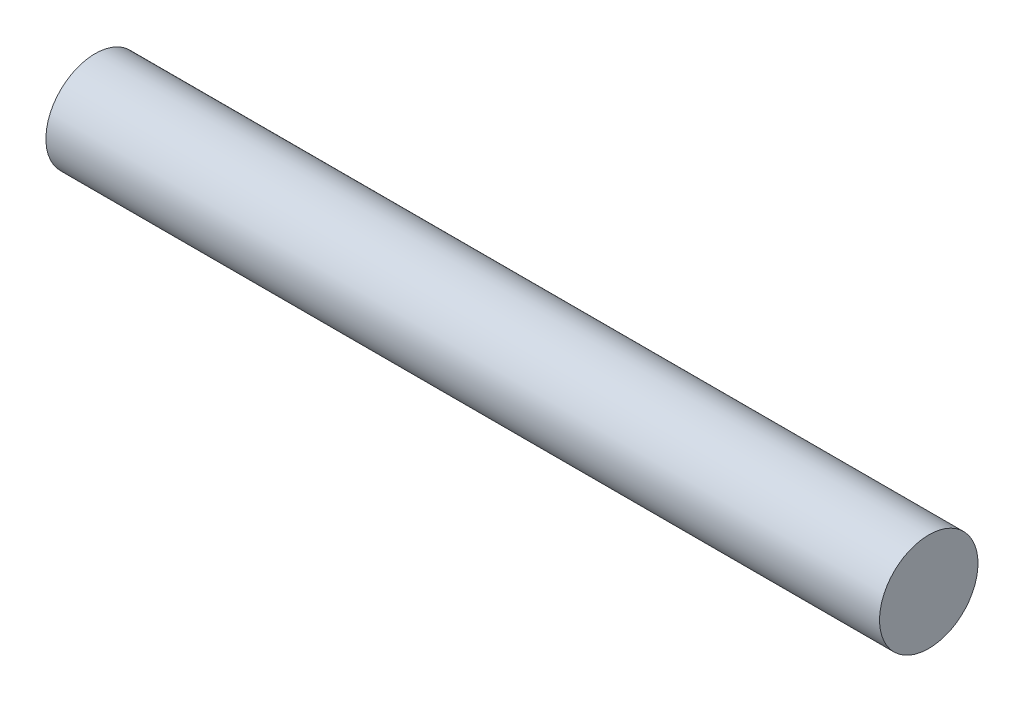
ISO-10303-21;
HEADER;
FILE_DESCRIPTION(('STEP AP214'),'2;1');
FILE_NAME('part.step','',(''),(''),'','','');
FILE_SCHEMA(('AUTOMOTIVE_DESIGN { 1 0 10303 214 1 1 1 1 }'));
ENDSEC;
DATA;
#1=APPLICATION_CONTEXT('core data for automotive mechanical design processes');
#2=APPLICATION_PROTOCOL_DEFINITION('international standard','automotive_design',2000,#1);
#3=PRODUCT_CONTEXT('',#1,'mechanical');
#4=PRODUCT('Part','Part','',(#3));
#5=PRODUCT_RELATED_PRODUCT_CATEGORY('part','',(#4));
#6=PRODUCT_DEFINITION_FORMATION('','',#4);
#7=PRODUCT_DEFINITION_CONTEXT('part definition',#1,'design');
#8=PRODUCT_DEFINITION('design','',#6,#7);
#9=PRODUCT_DEFINITION_SHAPE('','',#8);
#10=(LENGTH_UNIT() NAMED_UNIT(*) SI_UNIT(.MILLI.,.METRE.));
#11=(NAMED_UNIT(*) PLANE_ANGLE_UNIT() SI_UNIT($,.RADIAN.));
#12=(NAMED_UNIT(*) SI_UNIT($,.STERADIAN.) SOLID_ANGLE_UNIT());
#13=UNCERTAINTY_MEASURE_WITH_UNIT(LENGTH_MEASURE(1.E-05),#10,'distance_accuracy_value','');
#14=(GEOMETRIC_REPRESENTATION_CONTEXT(3) GLOBAL_UNCERTAINTY_ASSIGNED_CONTEXT((#13)) GLOBAL_UNIT_ASSIGNED_CONTEXT((#10,
#11,#12)) REPRESENTATION_CONTEXT('',''));
#15=CARTESIAN_POINT('',(0.,0.,0.));
#16=DIRECTION('',(0.,0.,1.));
#17=DIRECTION('',(1.,0.,0.));
#18=AXIS2_PLACEMENT_3D('',#15,#16,#17);
#19=CARTESIAN_POINT('',(2.54,0.,0.));
#20=DIRECTION('',(-1.,0.,0.));
#21=DIRECTION('',(0.,0.,1.));
#22=AXIS2_PLACEMENT_3D('',#19,#20,#21);
#23=CYLINDRICAL_SURFACE('',#22,0.15);
#24=CARTESIAN_POINT('',(2.54,0.,0.));
#25=DIRECTION('',(1.,0.,0.));
#26=DIRECTION('',(0.,0.,-1.));
#27=AXIS2_PLACEMENT_3D('',#24,#25,#26);
#28=CIRCLE('',#27,0.15);
#29=CARTESIAN_POINT('',(2.54,0.,-0.15));
#30=VERTEX_POINT('',#29);
#31=EDGE_CURVE('E10',#30,#30,#28,.T.);
#32=ORIENTED_EDGE('',*,*,#31,.F.);
#33=EDGE_LOOP('',(#32));
#34=FACE_BOUND('',#33,.T.);
#35=CARTESIAN_POINT('',(0.,0.,0.));
#36=DIRECTION('',(1.,0.,0.));
#37=DIRECTION('',(0.,0.,-1.));
#38=AXIS2_PLACEMENT_3D('',#35,#36,#37);
#39=CIRCLE('',#38,0.15);
#40=CARTESIAN_POINT('',(0.,0.,-0.15));
#41=VERTEX_POINT('',#40);
#42=EDGE_CURVE('E34',#41,#41,#39,.T.);
#43=ORIENTED_EDGE('',*,*,#42,.T.);
#44=EDGE_LOOP('',(#43));
#45=FACE_BOUND('',#44,.T.);
#46=ADVANCED_FACE('F31',(#34,#45),#23,.T.);
#47=CARTESIAN_POINT('',(2.54,0.,0.));
#48=DIRECTION('',(1.,0.,0.));
#49=DIRECTION('',(0.,0.,-1.));
#50=AXIS2_PLACEMENT_3D('',#47,#48,#49);
#51=PLANE('',#50);
#52=ORIENTED_EDGE('',*,*,#31,.T.);
#53=EDGE_LOOP('',(#52));
#54=FACE_BOUND('',#53,.T.);
#55=ADVANCED_FACE('F46',(#54),#51,.T.);
#56=CARTESIAN_POINT('',(0.,0.,0.));
#57=DIRECTION('',(1.,0.,0.));
#58=DIRECTION('',(0.,0.,-1.));
#59=AXIS2_PLACEMENT_3D('',#56,#57,#58);
#60=PLANE('',#59);
#61=ORIENTED_EDGE('',*,*,#42,.F.);
#62=EDGE_LOOP('',(#61));
#63=FACE_BOUND('',#62,.T.);
#64=ADVANCED_FACE('F44',(#63),#60,.F.);
#65=CLOSED_SHELL('',(#46,#55,#64));
#66=MANIFOLD_SOLID_BREP('B2',#65);
#67=ADVANCED_BREP_SHAPE_REPRESENTATION('',(#18,#66),#14);
#68=SHAPE_DEFINITION_REPRESENTATION(#9,#67);
ENDSEC;
END-ISO-10303-21;
